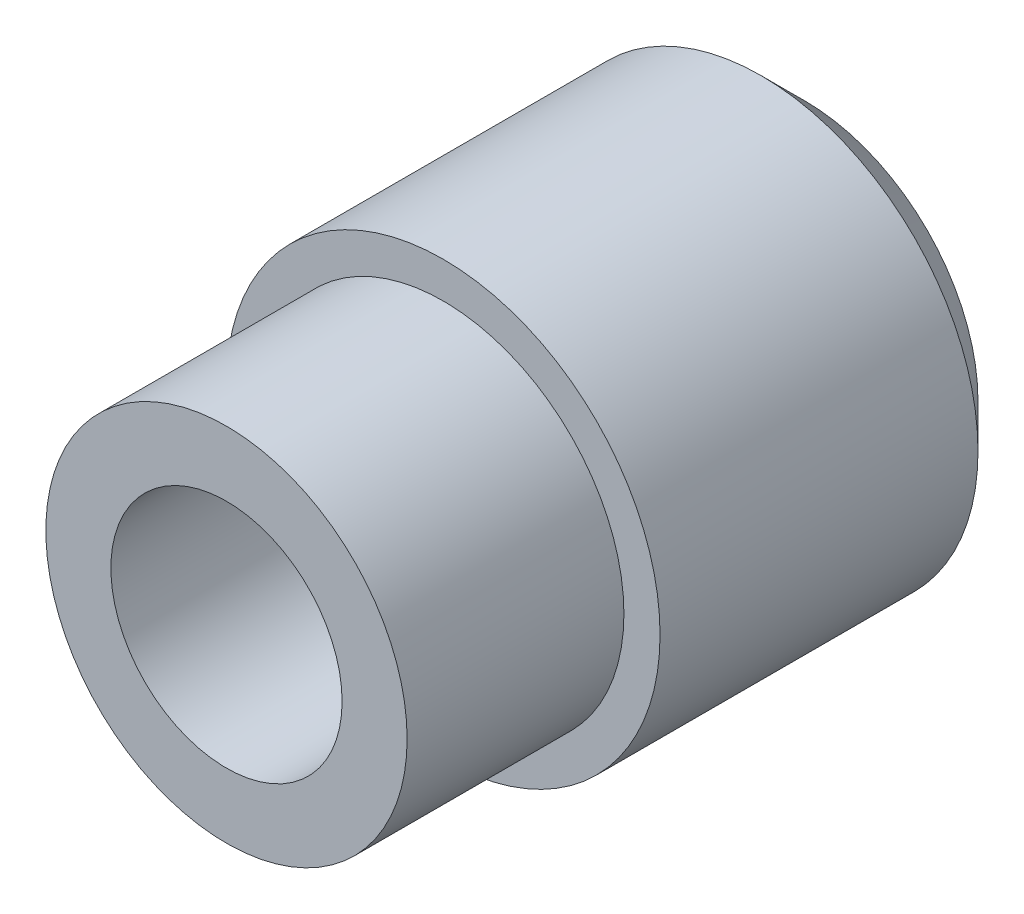
ISO-10303-21;
HEADER;
FILE_DESCRIPTION(('STEP AP214'),'2;1');
FILE_NAME('part.step','',(''),(''),'','','');
FILE_SCHEMA(('AUTOMOTIVE_DESIGN { 1 0 10303 214 1 1 1 1 }'));
ENDSEC;
DATA;
#1=APPLICATION_CONTEXT('core data for automotive mechanical design processes');
#2=APPLICATION_PROTOCOL_DEFINITION('international standard','automotive_design',2000,#1);
#3=PRODUCT_CONTEXT('',#1,'mechanical');
#4=PRODUCT('Part','Part','',(#3));
#5=PRODUCT_RELATED_PRODUCT_CATEGORY('part','',(#4));
#6=PRODUCT_DEFINITION_FORMATION('','',#4);
#7=PRODUCT_DEFINITION_CONTEXT('part definition',#1,'design');
#8=PRODUCT_DEFINITION('design','',#6,#7);
#9=PRODUCT_DEFINITION_SHAPE('','',#8);
#10=(LENGTH_UNIT() NAMED_UNIT(*) SI_UNIT(.MILLI.,.METRE.));
#11=(NAMED_UNIT(*) PLANE_ANGLE_UNIT() SI_UNIT($,.RADIAN.));
#12=(NAMED_UNIT(*) SI_UNIT($,.STERADIAN.) SOLID_ANGLE_UNIT());
#13=UNCERTAINTY_MEASURE_WITH_UNIT(LENGTH_MEASURE(1.E-05),#10,'distance_accuracy_value','');
#14=(GEOMETRIC_REPRESENTATION_CONTEXT(3) GLOBAL_UNCERTAINTY_ASSIGNED_CONTEXT((#13)) GLOBAL_UNIT_ASSIGNED_CONTEXT((#10,
#11,#12)) REPRESENTATION_CONTEXT('',''));
#15=CARTESIAN_POINT('',(0.,0.,0.));
#16=DIRECTION('',(0.,0.,1.));
#17=DIRECTION('',(1.,0.,0.));
#18=AXIS2_PLACEMENT_3D('',#15,#16,#17);
#19=CARTESIAN_POINT('',(0.,0.,1.99999999995271));
#20=DIRECTION('',(0.,0.,1.));
#21=DIRECTION('',(1.,0.,0.));
#22=AXIS2_PLACEMENT_3D('',#19,#20,#21);
#23=CONICAL_SURFACE('',#22,0.79999999991287,1.0297442586994);
#24=CARTESIAN_POINT('',(0.,0.,2.));
#25=DIRECTION('',(0.,0.,1.));
#26=DIRECTION('',(1.,0.,0.));
#27=AXIS2_PLACEMENT_3D('',#24,#25,#26);
#28=CIRCLE('',#27,0.8);
#29=CARTESIAN_POINT('',(0.8,0.,2.));
#30=VERTEX_POINT('',#29);
#31=EDGE_CURVE('E73',#30,#30,#28,.T.);
#32=ORIENTED_EDGE('',*,*,#31,.T.);
#33=EDGE_LOOP('',(#32));
#34=FACE_BOUND('',#33,.T.);
#35=CARTESIAN_POINT('',(0.,0.,1.51931150480777));
#36=VERTEX_POINT('',#35);
#37=VERTEX_LOOP('',#36);
#38=FACE_BOUND('',#37,.T.);
#39=ADVANCED_FACE('F16',(#34,#38),#23,.F.);
#40=CARTESIAN_POINT('',(0.,0.,3.));
#41=DIRECTION('',(0.,0.,1.));
#42=DIRECTION('',(1.,0.,0.));
#43=AXIS2_PLACEMENT_3D('',#40,#41,#42);
#44=CYLINDRICAL_SURFACE('',#43,0.8);
#45=ORIENTED_EDGE('',*,*,#31,.F.);
#46=EDGE_LOOP('',(#45));
#47=FACE_BOUND('',#46,.T.);
#48=CARTESIAN_POINT('',(0.,0.,4.));
#49=DIRECTION('',(0.,0.,1.));
#50=DIRECTION('',(1.,0.,0.));
#51=AXIS2_PLACEMENT_3D('',#48,#49,#50);
#52=CIRCLE('',#51,0.8);
#53=CARTESIAN_POINT('',(0.8,0.,4.));
#54=VERTEX_POINT('',#53);
#55=EDGE_CURVE('E19',#54,#54,#52,.T.);
#56=ORIENTED_EDGE('',*,*,#55,.T.);
#57=EDGE_LOOP('',(#56));
#58=FACE_BOUND('',#57,.T.);
#59=ADVANCED_FACE('F28',(#47,#58),#44,.F.);
#60=CARTESIAN_POINT('',(0.,0.,4.));
#61=DIRECTION('',(0.,0.,-1.));
#62=DIRECTION('',(-1.,0.,0.));
#63=AXIS2_PLACEMENT_3D('',#60,#61,#62);
#64=PLANE('',#63);
#65=CARTESIAN_POINT('',(0.,0.,4.));
#66=DIRECTION('',(0.,0.,1.));
#67=DIRECTION('',(1.,0.,0.));
#68=AXIS2_PLACEMENT_3D('',#65,#66,#67);
#69=CIRCLE('',#68,1.25);
#70=CARTESIAN_POINT('',(1.25,0.,4.));
#71=VERTEX_POINT('',#70);
#72=EDGE_CURVE('E69',#71,#71,#69,.F.);
#73=ORIENTED_EDGE('',*,*,#72,.F.);
#74=EDGE_LOOP('',(#73));
#75=FACE_BOUND('',#74,.T.);
#76=ORIENTED_EDGE('',*,*,#55,.F.);
#77=EDGE_LOOP('',(#76));
#78=FACE_BOUND('',#77,.T.);
#79=ADVANCED_FACE('F34',(#75,#78),#64,.F.);
#80=CARTESIAN_POINT('',(0.,0.,0.));
#81=DIRECTION('',(0.,0.,-1.));
#82=DIRECTION('',(-1.,0.,0.));
#83=AXIS2_PLACEMENT_3D('',#80,#81,#82);
#84=PLANE('',#83);
#85=CARTESIAN_POINT('',(0.,0.,5.6843418860808E-11));
#86=DIRECTION('',(0.,0.,1.));
#87=DIRECTION('',(1.,0.,0.));
#88=AXIS2_PLACEMENT_3D('',#85,#86,#87);
#89=CIRCLE('',#88,1.19999999998299);
#90=CARTESIAN_POINT('',(1.19999999998299,0.,5.6843418860808E-11));
#91=VERTEX_POINT('',#90);
#92=EDGE_CURVE('E74',#91,#91,#89,.T.);
#93=ORIENTED_EDGE('',*,*,#92,.F.);
#94=EDGE_LOOP('',(#93));
#95=FACE_BOUND('',#94,.T.);
#96=ADVANCED_FACE('F57',(#95),#84,.T.);
#97=CARTESIAN_POINT('',(0.,0.,2.5));
#98=DIRECTION('',(0.,0.,1.));
#99=DIRECTION('',(1.,0.,0.));
#100=AXIS2_PLACEMENT_3D('',#97,#98,#99);
#101=CYLINDRICAL_SURFACE('',#100,1.25);
#102=CARTESIAN_POINT('',(0.,0.,2.5));
#103=DIRECTION('',(0.,0.,1.));
#104=DIRECTION('',(1.,0.,0.));
#105=AXIS2_PLACEMENT_3D('',#102,#103,#104);
#106=CIRCLE('',#105,1.25);
#107=CARTESIAN_POINT('',(1.25,0.,2.5));
#108=VERTEX_POINT('',#107);
#109=EDGE_CURVE('E79',#108,#108,#106,.T.);
#110=ORIENTED_EDGE('',*,*,#109,.T.);
#111=EDGE_LOOP('',(#110));
#112=FACE_BOUND('',#111,.T.);
#113=ORIENTED_EDGE('',*,*,#72,.T.);
#114=EDGE_LOOP('',(#113));
#115=FACE_BOUND('',#114,.T.);
#116=ADVANCED_FACE('F53',(#112,#115),#101,.T.);
#117=CARTESIAN_POINT('',(0.,0.,0.299999999981537));
#118=DIRECTION('',(0.,0.,1.));
#119=DIRECTION('',(1.,0.,0.));
#120=AXIS2_PLACEMENT_3D('',#117,#118,#119);
#121=CONICAL_SURFACE('',#120,1.49999999996453,0.785398163492187);
#122=ORIENTED_EDGE('',*,*,#92,.T.);
#123=EDGE_LOOP('',(#122));
#124=FACE_BOUND('',#123,.T.);
#125=CARTESIAN_POINT('',(0.,0.,0.3));
#126=DIRECTION('',(0.,0.,1.));
#127=DIRECTION('',(1.,0.,0.));
#128=AXIS2_PLACEMENT_3D('',#125,#126,#127);
#129=CIRCLE('',#128,1.5);
#130=CARTESIAN_POINT('',(1.5,0.,0.3));
#131=VERTEX_POINT('',#130);
#132=EDGE_CURVE('E23',#131,#131,#129,.T.);
#133=ORIENTED_EDGE('',*,*,#132,.F.);
#134=EDGE_LOOP('',(#133));
#135=FACE_BOUND('',#134,.T.);
#136=ADVANCED_FACE('F45',(#124,#135),#121,.T.);
#137=CARTESIAN_POINT('',(0.,0.,2.5));
#138=DIRECTION('',(0.,0.,-1.));
#139=DIRECTION('',(-1.,0.,0.));
#140=AXIS2_PLACEMENT_3D('',#137,#138,#139);
#141=PLANE('',#140);
#142=CARTESIAN_POINT('',(0.,0.,2.5));
#143=DIRECTION('',(0.,0.,1.));
#144=DIRECTION('',(1.,0.,0.));
#145=AXIS2_PLACEMENT_3D('',#142,#143,#144);
#146=CIRCLE('',#145,1.5);
#147=CARTESIAN_POINT('',(1.5,0.,2.5));
#148=VERTEX_POINT('',#147);
#149=EDGE_CURVE('E10',#148,#148,#146,.F.);
#150=ORIENTED_EDGE('',*,*,#149,.F.);
#151=EDGE_LOOP('',(#150));
#152=FACE_BOUND('',#151,.T.);
#153=ORIENTED_EDGE('',*,*,#109,.F.);
#154=EDGE_LOOP('',(#153));
#155=FACE_BOUND('',#154,.T.);
#156=ADVANCED_FACE('F39',(#152,#155),#141,.F.);
#157=CARTESIAN_POINT('',(0.,0.,0.));
#158=DIRECTION('',(0.,0.,1.));
#159=DIRECTION('',(1.,0.,0.));
#160=AXIS2_PLACEMENT_3D('',#157,#158,#159);
#161=CYLINDRICAL_SURFACE('',#160,1.5);
#162=ORIENTED_EDGE('',*,*,#132,.T.);
#163=EDGE_LOOP('',(#162));
#164=FACE_BOUND('',#163,.T.);
#165=ORIENTED_EDGE('',*,*,#149,.T.);
#166=EDGE_LOOP('',(#165));
#167=FACE_BOUND('',#166,.T.);
#168=ADVANCED_FACE('F37',(#164,#167),#161,.T.);
#169=CLOSED_SHELL('',(#39,#59,#79,#96,#116,#136,#156,#168));
#170=MANIFOLD_SOLID_BREP('B1',#169);
#171=ADVANCED_BREP_SHAPE_REPRESENTATION('',(#18,#170),#14);
#172=SHAPE_DEFINITION_REPRESENTATION(#9,#171);
ENDSEC;
END-ISO-10303-21;
